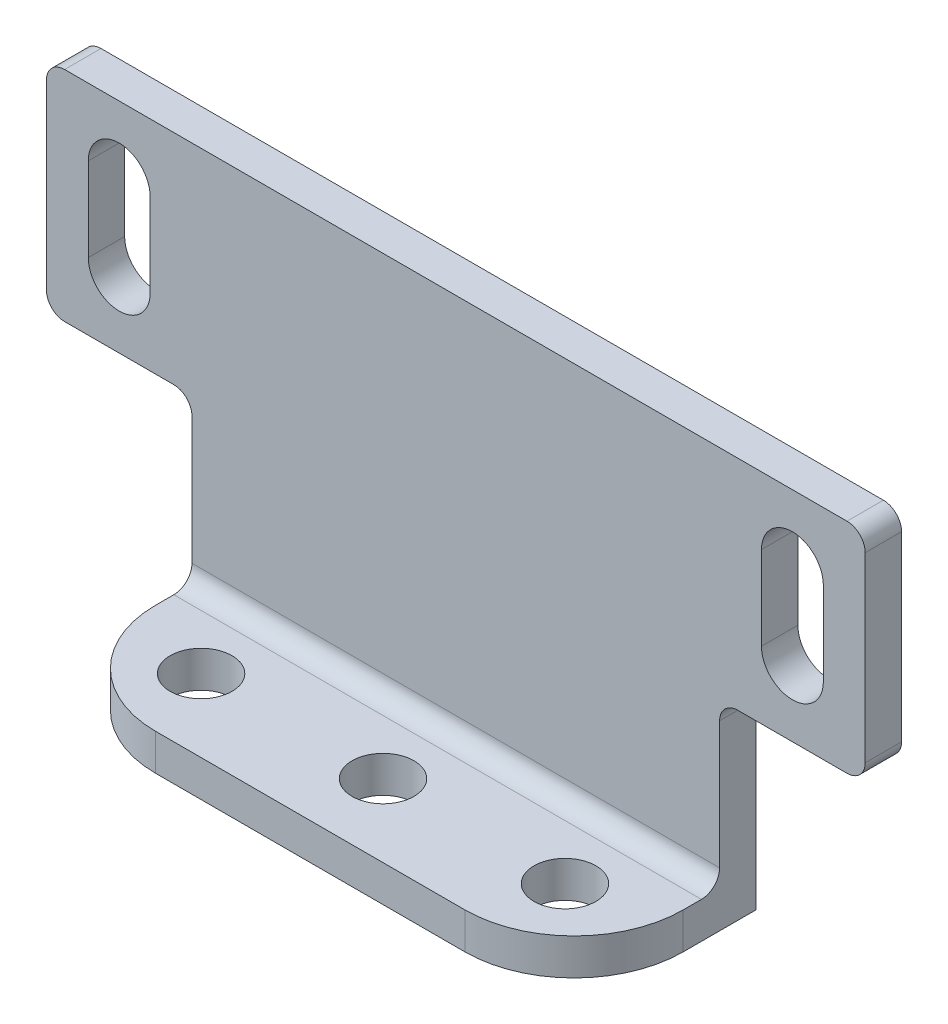
ISO-10303-21;
HEADER;
FILE_DESCRIPTION(('STEP AP214'),'2;1');
FILE_NAME('part.step','',(''),(''),'','','');
FILE_SCHEMA(('AUTOMOTIVE_DESIGN { 1 0 10303 214 1 1 1 1 }'));
ENDSEC;
DATA;
#1=APPLICATION_CONTEXT('core data for automotive mechanical design processes');
#2=APPLICATION_PROTOCOL_DEFINITION('international standard','automotive_design',2000,#1);
#3=PRODUCT_CONTEXT('',#1,'mechanical');
#4=PRODUCT('Part','Part','',(#3));
#5=PRODUCT_RELATED_PRODUCT_CATEGORY('part','',(#4));
#6=PRODUCT_DEFINITION_FORMATION('','',#4);
#7=PRODUCT_DEFINITION_CONTEXT('part definition',#1,'design');
#8=PRODUCT_DEFINITION('design','',#6,#7);
#9=PRODUCT_DEFINITION_SHAPE('','',#8);
#10=(LENGTH_UNIT() NAMED_UNIT(*) SI_UNIT(.MILLI.,.METRE.));
#11=(NAMED_UNIT(*) PLANE_ANGLE_UNIT() SI_UNIT($,.RADIAN.));
#12=(NAMED_UNIT(*) SI_UNIT($,.STERADIAN.) SOLID_ANGLE_UNIT());
#13=UNCERTAINTY_MEASURE_WITH_UNIT(LENGTH_MEASURE(1.E-05),#10,'distance_accuracy_value','');
#14=(GEOMETRIC_REPRESENTATION_CONTEXT(3) GLOBAL_UNCERTAINTY_ASSIGNED_CONTEXT((#13)) GLOBAL_UNIT_ASSIGNED_CONTEXT((#10,
#11,#12)) REPRESENTATION_CONTEXT('',''));
#15=CARTESIAN_POINT('',(0.,0.,0.));
#16=DIRECTION('',(0.,0.,1.));
#17=DIRECTION('',(1.,0.,0.));
#18=AXIS2_PLACEMENT_3D('',#15,#16,#17);
#19=CARTESIAN_POINT('',(22.5,5.,2.));
#20=DIRECTION('',(-1.,0.,0.));
#21=DIRECTION('',(0.,0.,1.));
#22=AXIS2_PLACEMENT_3D('',#19,#20,#21);
#23=PLANE('',#22);
#24=DIRECTION('',(0.,1.,0.));
#25=VECTOR('',#24,1.);
#26=CARTESIAN_POINT('',(22.5,5.,0.));
#27=LINE('',#26,#25);
#28=CARTESIAN_POINT('',(22.5,-6.,0.));
#29=VERTEX_POINT('',#28);
#30=CARTESIAN_POINT('',(22.5,4.,0.));
#31=VERTEX_POINT('',#30);
#32=EDGE_CURVE('E389',#29,#31,#27,.T.);
#33=ORIENTED_EDGE('',*,*,#32,.T.);
#34=DIRECTION('',(0.,0.,-1.));
#35=VECTOR('',#34,1.);
#36=CARTESIAN_POINT('',(22.5,4.,2.));
#37=LINE('',#36,#35);
#38=CARTESIAN_POINT('',(22.5,4.,2.));
#39=VERTEX_POINT('',#38);
#40=EDGE_CURVE('E467',#31,#39,#37,.F.);
#41=ORIENTED_EDGE('',*,*,#40,.T.);
#42=DIRECTION('',(0.,1.,0.));
#43=VECTOR('',#42,1.);
#44=CARTESIAN_POINT('',(22.5,5.,2.));
#45=LINE('',#44,#43);
#46=CARTESIAN_POINT('',(22.5,-6.,2.));
#47=VERTEX_POINT('',#46);
#48=EDGE_CURVE('E400',#47,#39,#45,.T.);
#49=ORIENTED_EDGE('',*,*,#48,.F.);
#50=DIRECTION('',(0.,0.,1.));
#51=VECTOR('',#50,1.);
#52=CARTESIAN_POINT('',(22.5,-6.,0.));
#53=LINE('',#52,#51);
#54=EDGE_CURVE('E465',#47,#29,#53,.F.);
#55=ORIENTED_EDGE('',*,*,#54,.T.);
#56=EDGE_LOOP('',(#33,#41,#49,#55));
#57=FACE_BOUND('',#56,.T.);
#58=ADVANCED_FACE('F183',(#57),#23,.F.);
#59=CARTESIAN_POINT('',(-22.5,-18.,2.));
#60=DIRECTION('',(0.,1.,0.));
#61=DIRECTION('',(0.,0.,1.));
#62=AXIS2_PLACEMENT_3D('',#59,#60,#61);
#63=PLANE('',#62);
#64=CARTESIAN_POINT('',(-10.,-18.,6.));
#65=DIRECTION('',(0.,1.,0.));
#66=DIRECTION('',(0.,0.,1.));
#67=AXIS2_PLACEMENT_3D('',#64,#65,#66);
#68=CIRCLE('',#67,1.7);
#69=CARTESIAN_POINT('',(-10.,-18.,7.7));
#70=VERTEX_POINT('',#69);
#71=EDGE_CURVE('E598',#70,#70,#68,.T.);
#72=ORIENTED_EDGE('',*,*,#71,.T.);
#73=EDGE_LOOP('',(#72));
#74=FACE_BOUND('',#73,.T.);
#75=CARTESIAN_POINT('',(0.,-18.,6.));
#76=DIRECTION('',(0.,1.,0.));
#77=DIRECTION('',(0.,0.,1.));
#78=AXIS2_PLACEMENT_3D('',#75,#76,#77);
#79=CIRCLE('',#78,1.7);
#80=CARTESIAN_POINT('',(0.,-18.,7.7));
#81=VERTEX_POINT('',#80);
#82=EDGE_CURVE('E592',#81,#81,#79,.T.);
#83=ORIENTED_EDGE('',*,*,#82,.T.);
#84=EDGE_LOOP('',(#83));
#85=FACE_BOUND('',#84,.T.);
#86=CARTESIAN_POINT('',(10.,-18.,6.));
#87=DIRECTION('',(0.,1.,0.));
#88=DIRECTION('',(0.,0.,1.));
#89=AXIS2_PLACEMENT_3D('',#86,#87,#88);
#90=CIRCLE('',#89,1.7);
#91=CARTESIAN_POINT('',(10.,-18.,7.7));
#92=VERTEX_POINT('',#91);
#93=EDGE_CURVE('E414',#92,#92,#90,.T.);
#94=ORIENTED_EDGE('',*,*,#93,.T.);
#95=EDGE_LOOP('',(#94));
#96=FACE_BOUND('',#95,.T.);
#97=DIRECTION('',(1.,0.,0.));
#98=VECTOR('',#97,1.);
#99=CARTESIAN_POINT('',(-22.5,-18.,0.));
#100=LINE('',#99,#98);
#101=CARTESIAN_POINT('',(-14.5,-18.,0.));
#102=VERTEX_POINT('',#101);
#103=CARTESIAN_POINT('',(14.5,-18.,0.));
#104=VERTEX_POINT('',#103);
#105=EDGE_CURVE('E365',#102,#104,#100,.T.);
#106=ORIENTED_EDGE('',*,*,#105,.T.);
#107=DIRECTION('',(0.,0.,-1.));
#108=VECTOR('',#107,1.);
#109=CARTESIAN_POINT('',(14.5,-18.,10.));
#110=LINE('',#109,#108);
#111=CARTESIAN_POINT('',(14.5,-18.,4.));
#112=VERTEX_POINT('',#111);
#113=EDGE_CURVE('E376',#112,#104,#110,.T.);
#114=ORIENTED_EDGE('',*,*,#113,.F.);
#115=CARTESIAN_POINT('',(8.50000000000001,-18.,4.));
#116=DIRECTION('',(0.,1.,0.));
#117=DIRECTION('',(0.,0.,1.));
#118=AXIS2_PLACEMENT_3D('',#115,#116,#117);
#119=CIRCLE('',#118,6.);
#120=CARTESIAN_POINT('',(8.5,-18.,10.));
#121=VERTEX_POINT('',#120);
#122=EDGE_CURVE('E429',#112,#121,#119,.F.);
#123=ORIENTED_EDGE('',*,*,#122,.T.);
#124=DIRECTION('',(1.,0.,0.));
#125=VECTOR('',#124,1.);
#126=CARTESIAN_POINT('',(-22.5,-18.,10.));
#127=LINE('',#126,#125);
#128=CARTESIAN_POINT('',(-8.49999999999999,-18.,10.));
#129=VERTEX_POINT('',#128);
#130=EDGE_CURVE('E396',#129,#121,#127,.T.);
#131=ORIENTED_EDGE('',*,*,#130,.F.);
#132=CARTESIAN_POINT('',(-8.49999999999999,-18.,4.));
#133=DIRECTION('',(0.,1.,0.));
#134=DIRECTION('',(0.,0.,1.));
#135=AXIS2_PLACEMENT_3D('',#132,#133,#134);
#136=CIRCLE('',#135,6.);
#137=CARTESIAN_POINT('',(-14.5,-18.,4.));
#138=VERTEX_POINT('',#137);
#139=EDGE_CURVE('E427',#129,#138,#136,.F.);
#140=ORIENTED_EDGE('',*,*,#139,.T.);
#141=DIRECTION('',(0.,0.,-1.));
#142=VECTOR('',#141,1.);
#143=CARTESIAN_POINT('',(-14.5,-18.,10.));
#144=LINE('',#143,#142);
#145=EDGE_CURVE('E388',#138,#102,#144,.T.);
#146=ORIENTED_EDGE('',*,*,#145,.T.);
#147=EDGE_LOOP('',(#106,#114,#123,#131,#140,#146));
#148=FACE_BOUND('',#147,.T.);
#149=ADVANCED_FACE('F386',(#74,#85,#96,#148),#63,.F.);
#150=CARTESIAN_POINT('',(0.,0.,2.));
#151=DIRECTION('',(0.,0.,1.));
#152=DIRECTION('',(1.,0.,0.));
#153=AXIS2_PLACEMENT_3D('',#150,#151,#152);
#154=PLANE('',#153);
#155=DIRECTION('',(0.,-1.,0.));
#156=VECTOR('',#155,1.);
#157=CARTESIAN_POINT('',(-20.2,0.,2.));
#158=LINE('',#157,#156);
#159=CARTESIAN_POINT('',(-20.2,1.29999999999999,2.));
#160=VERTEX_POINT('',#159);
#161=CARTESIAN_POINT('',(-20.2,-3.30000000000001,2.));
#162=VERTEX_POINT('',#161);
#163=EDGE_CURVE('E561',#160,#162,#158,.T.);
#164=ORIENTED_EDGE('',*,*,#163,.F.);
#165=CARTESIAN_POINT('',(-18.5,1.29999999999999,2.));
#166=DIRECTION('',(0.,0.,1.));
#167=DIRECTION('',(1.,0.,0.));
#168=AXIS2_PLACEMENT_3D('',#165,#166,#167);
#169=CIRCLE('',#168,1.69999999999999);
#170=CARTESIAN_POINT('',(-16.8,1.29999999999999,2.));
#171=VERTEX_POINT('',#170);
#172=EDGE_CURVE('E559',#171,#160,#169,.T.);
#173=ORIENTED_EDGE('',*,*,#172,.F.);
#174=DIRECTION('',(0.,-1.,0.));
#175=VECTOR('',#174,1.);
#176=CARTESIAN_POINT('',(-16.8,0.,2.));
#177=LINE('',#176,#175);
#178=CARTESIAN_POINT('',(-16.8,-3.30000000000001,2.));
#179=VERTEX_POINT('',#178);
#180=EDGE_CURVE('E563',#171,#179,#177,.T.);
#181=ORIENTED_EDGE('',*,*,#180,.T.);
#182=CARTESIAN_POINT('',(-18.5,-3.30000000000001,2.));
#183=DIRECTION('',(0.,0.,1.));
#184=DIRECTION('',(1.,0.,0.));
#185=AXIS2_PLACEMENT_3D('',#182,#183,#184);
#186=CIRCLE('',#185,1.69999999999999);
#187=EDGE_CURVE('E556',#162,#179,#186,.T.);
#188=ORIENTED_EDGE('',*,*,#187,.F.);
#189=EDGE_LOOP('',(#164,#173,#181,#188));
#190=FACE_BOUND('',#189,.T.);
#191=CARTESIAN_POINT('',(18.5,1.29999999999999,2.));
#192=DIRECTION('',(0.,0.,1.));
#193=DIRECTION('',(1.,0.,0.));
#194=AXIS2_PLACEMENT_3D('',#191,#192,#193);
#195=CIRCLE('',#194,1.69999999999999);
#196=CARTESIAN_POINT('',(20.2,1.29999999999999,2.));
#197=VERTEX_POINT('',#196);
#198=CARTESIAN_POINT('',(16.8,1.29999999999999,2.));
#199=VERTEX_POINT('',#198);
#200=EDGE_CURVE('E424',#197,#199,#195,.T.);
#201=ORIENTED_EDGE('',*,*,#200,.F.);
#202=DIRECTION('',(0.,-1.,0.));
#203=VECTOR('',#202,1.);
#204=CARTESIAN_POINT('',(20.2,0.,2.));
#205=LINE('',#204,#203);
#206=CARTESIAN_POINT('',(20.2,-3.30000000000001,2.));
#207=VERTEX_POINT('',#206);
#208=EDGE_CURVE('E408',#197,#207,#205,.T.);
#209=ORIENTED_EDGE('',*,*,#208,.T.);
#210=CARTESIAN_POINT('',(18.5,-3.30000000000001,2.));
#211=DIRECTION('',(0.,0.,1.));
#212=DIRECTION('',(1.,0.,0.));
#213=AXIS2_PLACEMENT_3D('',#210,#211,#212);
#214=CIRCLE('',#213,1.69999999999999);
#215=CARTESIAN_POINT('',(16.8,-3.30000000000001,2.));
#216=VERTEX_POINT('',#215);
#217=EDGE_CURVE('E421',#216,#207,#214,.T.);
#218=ORIENTED_EDGE('',*,*,#217,.F.);
#219=DIRECTION('',(0.,-1.,0.));
#220=VECTOR('',#219,1.);
#221=CARTESIAN_POINT('',(16.8,0.,2.));
#222=LINE('',#221,#220);
#223=EDGE_CURVE('E586',#199,#216,#222,.T.);
#224=ORIENTED_EDGE('',*,*,#223,.F.);
#225=EDGE_LOOP('',(#201,#209,#218,#224));
#226=FACE_BOUND('',#225,.T.);
#227=ORIENTED_EDGE('',*,*,#48,.T.);
#228=CARTESIAN_POINT('',(21.5,4.,2.));
#229=DIRECTION('',(0.,0.,1.));
#230=DIRECTION('',(1.,0.,0.));
#231=AXIS2_PLACEMENT_3D('',#228,#229,#230);
#232=CIRCLE('',#231,1.);
#233=CARTESIAN_POINT('',(21.5,5.,2.));
#234=VERTEX_POINT('',#233);
#235=EDGE_CURVE('E474',#39,#234,#232,.T.);
#236=ORIENTED_EDGE('',*,*,#235,.T.);
#237=DIRECTION('',(-1.,0.,0.));
#238=VECTOR('',#237,1.);
#239=CARTESIAN_POINT('',(-22.5,5.,2.));
#240=LINE('',#239,#238);
#241=CARTESIAN_POINT('',(-21.5,5.,2.));
#242=VERTEX_POINT('',#241);
#243=EDGE_CURVE('E403',#234,#242,#240,.T.);
#244=ORIENTED_EDGE('',*,*,#243,.T.);
#245=CARTESIAN_POINT('',(-21.5,4.,2.));
#246=DIRECTION('',(0.,0.,1.));
#247=DIRECTION('',(1.,0.,0.));
#248=AXIS2_PLACEMENT_3D('',#245,#246,#247);
#249=CIRCLE('',#248,1.);
#250=CARTESIAN_POINT('',(-22.5,4.,2.));
#251=VERTEX_POINT('',#250);
#252=EDGE_CURVE('E470',#242,#251,#249,.T.);
#253=ORIENTED_EDGE('',*,*,#252,.T.);
#254=DIRECTION('',(0.,-1.,0.));
#255=VECTOR('',#254,1.);
#256=CARTESIAN_POINT('',(-22.5,5.,2.));
#257=LINE('',#256,#255);
#258=CARTESIAN_POINT('',(-22.5,-6.,2.));
#259=VERTEX_POINT('',#258);
#260=EDGE_CURVE('E407',#251,#259,#257,.T.);
#261=ORIENTED_EDGE('',*,*,#260,.T.);
#262=CARTESIAN_POINT('',(-21.5,-6.,2.));
#263=DIRECTION('',(0.,0.,1.));
#264=DIRECTION('',(1.,0.,0.));
#265=AXIS2_PLACEMENT_3D('',#262,#263,#264);
#266=CIRCLE('',#265,1.);
#267=CARTESIAN_POINT('',(-21.5,-7.,2.));
#268=VERTEX_POINT('',#267);
#269=EDGE_CURVE('E203',#259,#268,#266,.T.);
#270=ORIENTED_EDGE('',*,*,#269,.T.);
#271=DIRECTION('',(-1.,0.,0.));
#272=VECTOR('',#271,1.);
#273=CARTESIAN_POINT('',(-22.5,-7.,2.));
#274=LINE('',#273,#272);
#275=CARTESIAN_POINT('',(-15.5,-7.,2.));
#276=VERTEX_POINT('',#275);
#277=EDGE_CURVE('E383',#276,#268,#274,.T.);
#278=ORIENTED_EDGE('',*,*,#277,.F.);
#279=CARTESIAN_POINT('',(-15.5,-8.,2.));
#280=DIRECTION('',(0.,0.,1.));
#281=DIRECTION('',(1.,0.,0.));
#282=AXIS2_PLACEMENT_3D('',#279,#280,#281);
#283=CIRCLE('',#282,1.);
#284=CARTESIAN_POINT('',(-14.5,-8.,2.));
#285=VERTEX_POINT('',#284);
#286=EDGE_CURVE('E191',#276,#285,#283,.F.);
#287=ORIENTED_EDGE('',*,*,#286,.T.);
#288=DIRECTION('',(0.,1.,0.));
#289=VECTOR('',#288,1.);
#290=CARTESIAN_POINT('',(-14.5,-18.,2.));
#291=LINE('',#290,#289);
#292=CARTESIAN_POINT('',(-14.5,-15.,2.));
#293=VERTEX_POINT('',#292);
#294=EDGE_CURVE('E520',#293,#285,#291,.T.);
#295=ORIENTED_EDGE('',*,*,#294,.F.);
#296=DIRECTION('',(1.,0.,0.));
#297=VECTOR('',#296,1.);
#298=CARTESIAN_POINT('',(0.,-15.,2.));
#299=LINE('',#298,#297);
#300=CARTESIAN_POINT('',(14.5,-15.,2.));
#301=VERTEX_POINT('',#300);
#302=EDGE_CURVE('E442',#293,#301,#299,.T.);
#303=ORIENTED_EDGE('',*,*,#302,.T.);
#304=DIRECTION('',(0.,1.,0.));
#305=VECTOR('',#304,1.);
#306=CARTESIAN_POINT('',(14.5,-18.,2.));
#307=LINE('',#306,#305);
#308=CARTESIAN_POINT('',(14.5,-8.,2.));
#309=VERTEX_POINT('',#308);
#310=EDGE_CURVE('E502',#301,#309,#307,.T.);
#311=ORIENTED_EDGE('',*,*,#310,.T.);
#312=CARTESIAN_POINT('',(15.5,-8.,2.));
#313=DIRECTION('',(0.,0.,1.));
#314=DIRECTION('',(1.,0.,0.));
#315=AXIS2_PLACEMENT_3D('',#312,#313,#314);
#316=CIRCLE('',#315,1.);
#317=CARTESIAN_POINT('',(15.5,-7.,2.));
#318=VERTEX_POINT('',#317);
#319=EDGE_CURVE('E496',#309,#318,#316,.F.);
#320=ORIENTED_EDGE('',*,*,#319,.T.);
#321=DIRECTION('',(1.,0.,0.));
#322=VECTOR('',#321,1.);
#323=CARTESIAN_POINT('',(22.5,-7.,2.));
#324=LINE('',#323,#322);
#325=CARTESIAN_POINT('',(21.5,-7.,2.));
#326=VERTEX_POINT('',#325);
#327=EDGE_CURVE('E372',#318,#326,#324,.T.);
#328=ORIENTED_EDGE('',*,*,#327,.T.);
#329=CARTESIAN_POINT('',(21.5,-6.,2.));
#330=DIRECTION('',(0.,0.,1.));
#331=DIRECTION('',(1.,0.,0.));
#332=AXIS2_PLACEMENT_3D('',#329,#330,#331);
#333=CIRCLE('',#332,1.);
#334=EDGE_CURVE('E472',#326,#47,#333,.T.);
#335=ORIENTED_EDGE('',*,*,#334,.T.);
#336=EDGE_LOOP('',(#227,#236,#244,#253,#261,#270,#278,#287,#295,#303,#311,#320,#328,#335));
#337=FACE_BOUND('',#336,.T.);
#338=ADVANCED_FACE('F501',(#190,#226,#337),#154,.T.);
#339=CARTESIAN_POINT('',(0.,0.,0.));
#340=DIRECTION('',(0.,0.,1.));
#341=DIRECTION('',(1.,0.,0.));
#342=AXIS2_PLACEMENT_3D('',#339,#340,#341);
#343=PLANE('',#342);
#344=CARTESIAN_POINT('',(18.5,-3.30000000000001,0.));
#345=DIRECTION('',(0.,0.,-1.));
#346=DIRECTION('',(-1.,0.,0.));
#347=AXIS2_PLACEMENT_3D('',#344,#345,#346);
#348=CIRCLE('',#347,1.69999999999999);
#349=CARTESIAN_POINT('',(20.2,-3.30000000000001,0.));
#350=VERTEX_POINT('',#349);
#351=CARTESIAN_POINT('',(16.8,-3.30000000000001,0.));
#352=VERTEX_POINT('',#351);
#353=EDGE_CURVE('E573',#350,#352,#348,.T.);
#354=ORIENTED_EDGE('',*,*,#353,.F.);
#355=DIRECTION('',(0.,1.,0.));
#356=VECTOR('',#355,1.);
#357=CARTESIAN_POINT('',(20.2,-3.30000000000001,0.));
#358=LINE('',#357,#356);
#359=CARTESIAN_POINT('',(20.2,1.29999999999999,0.));
#360=VERTEX_POINT('',#359);
#361=EDGE_CURVE('E568',#350,#360,#358,.T.);
#362=ORIENTED_EDGE('',*,*,#361,.T.);
#363=CARTESIAN_POINT('',(18.5,1.29999999999999,0.));
#364=DIRECTION('',(0.,0.,-1.));
#365=DIRECTION('',(-1.,0.,0.));
#366=AXIS2_PLACEMENT_3D('',#363,#364,#365);
#367=CIRCLE('',#366,1.69999999999999);
#368=CARTESIAN_POINT('',(16.8000000000001,1.29999999999999,0.));
#369=VERTEX_POINT('',#368);
#370=EDGE_CURVE('E581',#369,#360,#367,.T.);
#371=ORIENTED_EDGE('',*,*,#370,.F.);
#372=DIRECTION('',(0.,1.,0.));
#373=VECTOR('',#372,1.);
#374=CARTESIAN_POINT('',(16.8000000000001,-3.30000000000001,0.));
#375=LINE('',#374,#373);
#376=EDGE_CURVE('E566',#352,#369,#375,.T.);
#377=ORIENTED_EDGE('',*,*,#376,.F.);
#378=EDGE_LOOP('',(#354,#362,#371,#377));
#379=FACE_BOUND('',#378,.T.);
#380=CARTESIAN_POINT('',(-18.5,1.29999999999999,0.));
#381=DIRECTION('',(0.,0.,-1.));
#382=DIRECTION('',(-1.,0.,0.));
#383=AXIS2_PLACEMENT_3D('',#380,#381,#382);
#384=CIRCLE('',#383,1.69999999999999);
#385=CARTESIAN_POINT('',(-20.2,1.29999999999999,0.));
#386=VERTEX_POINT('',#385);
#387=CARTESIAN_POINT('',(-16.8,1.29999999999999,0.));
#388=VERTEX_POINT('',#387);
#389=EDGE_CURVE('E551',#386,#388,#384,.T.);
#390=ORIENTED_EDGE('',*,*,#389,.F.);
#391=DIRECTION('',(0.,1.,0.));
#392=VECTOR('',#391,1.);
#393=CARTESIAN_POINT('',(-20.2,-3.30000000000001,0.));
#394=LINE('',#393,#392);
#395=CARTESIAN_POINT('',(-20.2,-3.30000000000001,0.));
#396=VERTEX_POINT('',#395);
#397=EDGE_CURVE('E532',#396,#386,#394,.T.);
#398=ORIENTED_EDGE('',*,*,#397,.F.);
#399=CARTESIAN_POINT('',(-18.5,-3.30000000000001,0.));
#400=DIRECTION('',(0.,0.,-1.));
#401=DIRECTION('',(-1.,0.,0.));
#402=AXIS2_PLACEMENT_3D('',#399,#400,#401);
#403=CIRCLE('',#402,1.69999999999999);
#404=CARTESIAN_POINT('',(-16.8,-3.30000000000001,0.));
#405=VERTEX_POINT('',#404);
#406=EDGE_CURVE('E543',#405,#396,#403,.T.);
#407=ORIENTED_EDGE('',*,*,#406,.F.);
#408=DIRECTION('',(0.,1.,0.));
#409=VECTOR('',#408,1.);
#410=CARTESIAN_POINT('',(-16.8,-3.30000000000001,0.));
#411=LINE('',#410,#409);
#412=EDGE_CURVE('E538',#405,#388,#411,.T.);
#413=ORIENTED_EDGE('',*,*,#412,.T.);
#414=EDGE_LOOP('',(#390,#398,#407,#413));
#415=FACE_BOUND('',#414,.T.);
#416=DIRECTION('',(-1.,0.,0.));
#417=VECTOR('',#416,1.);
#418=CARTESIAN_POINT('',(-22.5,5.,0.));
#419=LINE('',#418,#417);
#420=CARTESIAN_POINT('',(21.5,5.,0.));
#421=VERTEX_POINT('',#420);
#422=CARTESIAN_POINT('',(-21.5,5.,0.));
#423=VERTEX_POINT('',#422);
#424=EDGE_CURVE('E393',#421,#423,#419,.T.);
#425=ORIENTED_EDGE('',*,*,#424,.F.);
#426=CARTESIAN_POINT('',(21.5,4.,0.));
#427=DIRECTION('',(0.,0.,1.));
#428=DIRECTION('',(1.,0.,0.));
#429=AXIS2_PLACEMENT_3D('',#426,#427,#428);
#430=CIRCLE('',#429,1.);
#431=EDGE_CURVE('E463',#421,#31,#430,.F.);
#432=ORIENTED_EDGE('',*,*,#431,.T.);
#433=ORIENTED_EDGE('',*,*,#32,.F.);
#434=CARTESIAN_POINT('',(21.5,-6.,0.));
#435=DIRECTION('',(0.,0.,1.));
#436=DIRECTION('',(1.,0.,0.));
#437=AXIS2_PLACEMENT_3D('',#434,#435,#436);
#438=CIRCLE('',#437,1.);
#439=CARTESIAN_POINT('',(21.5,-7.,0.));
#440=VERTEX_POINT('',#439);
#441=EDGE_CURVE('E461',#29,#440,#438,.F.);
#442=ORIENTED_EDGE('',*,*,#441,.T.);
#443=DIRECTION('',(-1.,0.,0.));
#444=VECTOR('',#443,1.);
#445=CARTESIAN_POINT('',(22.5,-7.,0.));
#446=LINE('',#445,#444);
#447=CARTESIAN_POINT('',(15.5,-7.,0.));
#448=VERTEX_POINT('',#447);
#449=EDGE_CURVE('E513',#440,#448,#446,.T.);
#450=ORIENTED_EDGE('',*,*,#449,.T.);
#451=CARTESIAN_POINT('',(15.5,-8.,0.));
#452=DIRECTION('',(0.,0.,1.));
#453=DIRECTION('',(1.,0.,0.));
#454=AXIS2_PLACEMENT_3D('',#451,#452,#453);
#455=CIRCLE('',#454,1.);
#456=CARTESIAN_POINT('',(14.5,-8.,0.));
#457=VERTEX_POINT('',#456);
#458=EDGE_CURVE('E368',#448,#457,#455,.T.);
#459=ORIENTED_EDGE('',*,*,#458,.T.);
#460=DIRECTION('',(0.,-1.,0.));
#461=VECTOR('',#460,1.);
#462=CARTESIAN_POINT('',(14.5,-18.,0.));
#463=LINE('',#462,#461);
#464=EDGE_CURVE('E359',#457,#104,#463,.T.);
#465=ORIENTED_EDGE('',*,*,#464,.T.);
#466=ORIENTED_EDGE('',*,*,#105,.F.);
#467=DIRECTION('',(0.,-1.,0.));
#468=VECTOR('',#467,1.);
#469=CARTESIAN_POINT('',(-14.5,-18.,0.));
#470=LINE('',#469,#468);
#471=CARTESIAN_POINT('',(-14.5,-8.,0.));
#472=VERTEX_POINT('',#471);
#473=EDGE_CURVE('E614',#472,#102,#470,.T.);
#474=ORIENTED_EDGE('',*,*,#473,.F.);
#475=CARTESIAN_POINT('',(-15.5,-8.,0.));
#476=DIRECTION('',(0.,0.,1.));
#477=DIRECTION('',(1.,0.,0.));
#478=AXIS2_PLACEMENT_3D('',#475,#476,#477);
#479=CIRCLE('',#478,1.);
#480=CARTESIAN_POINT('',(-15.5,-7.,0.));
#481=VERTEX_POINT('',#480);
#482=EDGE_CURVE('E13',#472,#481,#479,.T.);
#483=ORIENTED_EDGE('',*,*,#482,.T.);
#484=DIRECTION('',(1.,0.,0.));
#485=VECTOR('',#484,1.);
#486=CARTESIAN_POINT('',(-22.5,-7.,0.));
#487=LINE('',#486,#485);
#488=CARTESIAN_POINT('',(-21.5,-7.,0.));
#489=VERTEX_POINT('',#488);
#490=EDGE_CURVE('E523',#489,#481,#487,.T.);
#491=ORIENTED_EDGE('',*,*,#490,.F.);
#492=CARTESIAN_POINT('',(-21.5,-6.,0.));
#493=DIRECTION('',(0.,0.,1.));
#494=DIRECTION('',(1.,0.,0.));
#495=AXIS2_PLACEMENT_3D('',#492,#493,#494);
#496=CIRCLE('',#495,1.);
#497=CARTESIAN_POINT('',(-22.5,-6.,0.));
#498=VERTEX_POINT('',#497);
#499=EDGE_CURVE('E457',#489,#498,#496,.F.);
#500=ORIENTED_EDGE('',*,*,#499,.T.);
#501=DIRECTION('',(0.,-1.,0.));
#502=VECTOR('',#501,1.);
#503=CARTESIAN_POINT('',(-22.5,5.,0.));
#504=LINE('',#503,#502);
#505=CARTESIAN_POINT('',(-22.5,4.,0.));
#506=VERTEX_POINT('',#505);
#507=EDGE_CURVE('E404',#506,#498,#504,.T.);
#508=ORIENTED_EDGE('',*,*,#507,.F.);
#509=CARTESIAN_POINT('',(-21.5,4.,0.));
#510=DIRECTION('',(0.,0.,1.));
#511=DIRECTION('',(1.,0.,0.));
#512=AXIS2_PLACEMENT_3D('',#509,#510,#511);
#513=CIRCLE('',#512,1.);
#514=EDGE_CURVE('E459',#506,#423,#513,.F.);
#515=ORIENTED_EDGE('',*,*,#514,.T.);
#516=EDGE_LOOP('',(#425,#432,#433,#442,#450,#459,#465,#466,#474,#483,#491,#500,#508,#515));
#517=FACE_BOUND('',#516,.T.);
#518=ADVANCED_FACE('F362',(#379,#415,#517),#343,.F.);
#519=CARTESIAN_POINT('',(-22.5,-16.,10.));
#520=DIRECTION('',(0.,-1.,0.));
#521=DIRECTION('',(0.,0.,-1.));
#522=AXIS2_PLACEMENT_3D('',#519,#520,#521);
#523=PLANE('',#522);
#524=CARTESIAN_POINT('',(10.,-16.,6.));
#525=DIRECTION('',(0.,1.,0.));
#526=DIRECTION('',(0.,0.,1.));
#527=AXIS2_PLACEMENT_3D('',#524,#525,#526);
#528=CIRCLE('',#527,1.7);
#529=CARTESIAN_POINT('',(10.,-16.,7.7));
#530=VERTEX_POINT('',#529);
#531=EDGE_CURVE('E418',#530,#530,#528,.T.);
#532=ORIENTED_EDGE('',*,*,#531,.F.);
#533=EDGE_LOOP('',(#532));
#534=FACE_BOUND('',#533,.T.);
#535=CARTESIAN_POINT('',(0.,-16.,6.));
#536=DIRECTION('',(0.,1.,0.));
#537=DIRECTION('',(0.,0.,1.));
#538=AXIS2_PLACEMENT_3D('',#535,#536,#537);
#539=CIRCLE('',#538,1.7);
#540=CARTESIAN_POINT('',(0.,-16.,7.7));
#541=VERTEX_POINT('',#540);
#542=EDGE_CURVE('E417',#541,#541,#539,.T.);
#543=ORIENTED_EDGE('',*,*,#542,.F.);
#544=EDGE_LOOP('',(#543));
#545=FACE_BOUND('',#544,.T.);
#546=CARTESIAN_POINT('',(-10.,-16.,6.));
#547=DIRECTION('',(0.,1.,0.));
#548=DIRECTION('',(0.,0.,1.));
#549=AXIS2_PLACEMENT_3D('',#546,#547,#548);
#550=CIRCLE('',#549,1.7);
#551=CARTESIAN_POINT('',(-10.,-16.,7.7));
#552=VERTEX_POINT('',#551);
#553=EDGE_CURVE('E595',#552,#552,#550,.T.);
#554=ORIENTED_EDGE('',*,*,#553,.F.);
#555=EDGE_LOOP('',(#554));
#556=FACE_BOUND('',#555,.T.);
#557=DIRECTION('',(0.,0.,-1.));
#558=VECTOR('',#557,1.);
#559=CARTESIAN_POINT('',(14.5,-16.,10.));
#560=LINE('',#559,#558);
#561=CARTESIAN_POINT('',(14.5,-16.,4.));
#562=VERTEX_POINT('',#561);
#563=CARTESIAN_POINT('',(14.5,-16.,3.));
#564=VERTEX_POINT('',#563);
#565=EDGE_CURVE('E382',#562,#564,#560,.T.);
#566=ORIENTED_EDGE('',*,*,#565,.T.);
#567=DIRECTION('',(1.,0.,0.));
#568=VECTOR('',#567,1.);
#569=CARTESIAN_POINT('',(-22.5,-16.,3.));
#570=LINE('',#569,#568);
#571=CARTESIAN_POINT('',(-14.5,-16.,3.));
#572=VERTEX_POINT('',#571);
#573=EDGE_CURVE('E445',#564,#572,#570,.F.);
#574=ORIENTED_EDGE('',*,*,#573,.T.);
#575=DIRECTION('',(0.,0.,-1.));
#576=VECTOR('',#575,1.);
#577=CARTESIAN_POINT('',(-14.5,-16.,10.));
#578=LINE('',#577,#576);
#579=CARTESIAN_POINT('',(-14.5,-16.,4.));
#580=VERTEX_POINT('',#579);
#581=EDGE_CURVE('E528',#580,#572,#578,.T.);
#582=ORIENTED_EDGE('',*,*,#581,.F.);
#583=CARTESIAN_POINT('',(-8.49999999999999,-16.,4.));
#584=DIRECTION('',(0.,-1.,0.));
#585=DIRECTION('',(0.,0.,-1.));
#586=AXIS2_PLACEMENT_3D('',#583,#584,#585);
#587=CIRCLE('',#586,6.);
#588=CARTESIAN_POINT('',(-8.49999999999999,-16.,10.));
#589=VERTEX_POINT('',#588);
#590=EDGE_CURVE('E435',#580,#589,#587,.F.);
#591=ORIENTED_EDGE('',*,*,#590,.T.);
#592=DIRECTION('',(-1.,0.,0.));
#593=VECTOR('',#592,1.);
#594=CARTESIAN_POINT('',(-22.5,-16.,10.));
#595=LINE('',#594,#593);
#596=CARTESIAN_POINT('',(8.5,-16.,10.));
#597=VERTEX_POINT('',#596);
#598=EDGE_CURVE('E390',#597,#589,#595,.T.);
#599=ORIENTED_EDGE('',*,*,#598,.F.);
#600=CARTESIAN_POINT('',(8.50000000000001,-16.,4.));
#601=DIRECTION('',(0.,-1.,0.));
#602=DIRECTION('',(0.,0.,-1.));
#603=AXIS2_PLACEMENT_3D('',#600,#601,#602);
#604=CIRCLE('',#603,6.);
#605=EDGE_CURVE('E437',#597,#562,#604,.F.);
#606=ORIENTED_EDGE('',*,*,#605,.T.);
#607=EDGE_LOOP('',(#566,#574,#582,#591,#599,#606));
#608=FACE_BOUND('',#607,.T.);
#609=ADVANCED_FACE('F611',(#534,#545,#556,#608),#523,.F.);
#610=CARTESIAN_POINT('',(0.,0.,10.));
#611=DIRECTION('',(0.,0.,-1.));
#612=DIRECTION('',(-1.,0.,0.));
#613=AXIS2_PLACEMENT_3D('',#610,#611,#612);
#614=PLANE('',#613);
#615=ORIENTED_EDGE('',*,*,#130,.T.);
#616=DIRECTION('',(0.,-1.,0.));
#617=VECTOR('',#616,1.);
#618=CARTESIAN_POINT('',(8.50000000000001,-16.,10.));
#619=LINE('',#618,#617);
#620=EDGE_CURVE('E433',#121,#597,#619,.F.);
#621=ORIENTED_EDGE('',*,*,#620,.T.);
#622=ORIENTED_EDGE('',*,*,#598,.T.);
#623=DIRECTION('',(0.,1.,0.));
#624=VECTOR('',#623,1.);
#625=CARTESIAN_POINT('',(-8.49999999999999,-18.,10.));
#626=LINE('',#625,#624);
#627=EDGE_CURVE('E431',#589,#129,#626,.F.);
#628=ORIENTED_EDGE('',*,*,#627,.T.);
#629=EDGE_LOOP('',(#615,#621,#622,#628));
#630=FACE_BOUND('',#629,.T.);
#631=ADVANCED_FACE('F604',(#630),#614,.F.);
#632=CARTESIAN_POINT('',(-22.5,5.,2.));
#633=DIRECTION('',(0.,-1.,0.));
#634=DIRECTION('',(0.,0.,-1.));
#635=AXIS2_PLACEMENT_3D('',#632,#633,#634);
#636=PLANE('',#635);
#637=ORIENTED_EDGE('',*,*,#243,.F.);
#638=DIRECTION('',(0.,0.,-1.));
#639=VECTOR('',#638,1.);
#640=CARTESIAN_POINT('',(21.5,5.,2.));
#641=LINE('',#640,#639);
#642=EDGE_CURVE('E454',#234,#421,#641,.T.);
#643=ORIENTED_EDGE('',*,*,#642,.T.);
#644=ORIENTED_EDGE('',*,*,#424,.T.);
#645=DIRECTION('',(0.,0.,-1.));
#646=VECTOR('',#645,1.);
#647=CARTESIAN_POINT('',(-21.5,5.,2.));
#648=LINE('',#647,#646);
#649=EDGE_CURVE('E452',#423,#242,#648,.F.);
#650=ORIENTED_EDGE('',*,*,#649,.T.);
#651=EDGE_LOOP('',(#637,#643,#644,#650));
#652=FACE_BOUND('',#651,.T.);
#653=ADVANCED_FACE('F635',(#652),#636,.F.);
#654=CARTESIAN_POINT('',(-22.5,5.,2.));
#655=DIRECTION('',(1.,0.,0.));
#656=DIRECTION('',(0.,0.,-1.));
#657=AXIS2_PLACEMENT_3D('',#654,#655,#656);
#658=PLANE('',#657);
#659=ORIENTED_EDGE('',*,*,#260,.F.);
#660=DIRECTION('',(0.,0.,-1.));
#661=VECTOR('',#660,1.);
#662=CARTESIAN_POINT('',(-22.5,4.,2.));
#663=LINE('',#662,#661);
#664=EDGE_CURVE('E486',#251,#506,#663,.T.);
#665=ORIENTED_EDGE('',*,*,#664,.T.);
#666=ORIENTED_EDGE('',*,*,#507,.T.);
#667=DIRECTION('',(0.,0.,1.));
#668=VECTOR('',#667,1.);
#669=CARTESIAN_POINT('',(-22.5,-6.,2.));
#670=LINE('',#669,#668);
#671=EDGE_CURVE('E483',#498,#259,#670,.T.);
#672=ORIENTED_EDGE('',*,*,#671,.T.);
#673=EDGE_LOOP('',(#659,#665,#666,#672));
#674=FACE_BOUND('',#673,.T.);
#675=ADVANCED_FACE('F642',(#674),#658,.F.);
#676=CARTESIAN_POINT('',(-10.,-16.,6.));
#677=DIRECTION('',(0.,1.,0.));
#678=DIRECTION('',(0.,0.,1.));
#679=AXIS2_PLACEMENT_3D('',#676,#677,#678);
#680=CYLINDRICAL_SURFACE('',#679,1.7);
#681=ORIENTED_EDGE('',*,*,#553,.T.);
#682=EDGE_LOOP('',(#681));
#683=FACE_BOUND('',#682,.T.);
#684=ORIENTED_EDGE('',*,*,#71,.F.);
#685=EDGE_LOOP('',(#684));
#686=FACE_BOUND('',#685,.T.);
#687=ADVANCED_FACE('F783',(#683,#686),#680,.F.);
#688=CARTESIAN_POINT('',(0.,-16.,6.));
#689=DIRECTION('',(0.,1.,0.));
#690=DIRECTION('',(0.,0.,1.));
#691=AXIS2_PLACEMENT_3D('',#688,#689,#690);
#692=CYLINDRICAL_SURFACE('',#691,1.7);
#693=ORIENTED_EDGE('',*,*,#542,.T.);
#694=EDGE_LOOP('',(#693));
#695=FACE_BOUND('',#694,.T.);
#696=ORIENTED_EDGE('',*,*,#82,.F.);
#697=EDGE_LOOP('',(#696));
#698=FACE_BOUND('',#697,.T.);
#699=ADVANCED_FACE('F793',(#695,#698),#692,.F.);
#700=CARTESIAN_POINT('',(10.,-16.,6.));
#701=DIRECTION('',(0.,1.,0.));
#702=DIRECTION('',(0.,0.,1.));
#703=AXIS2_PLACEMENT_3D('',#700,#701,#702);
#704=CYLINDRICAL_SURFACE('',#703,1.7);
#705=ORIENTED_EDGE('',*,*,#531,.T.);
#706=EDGE_LOOP('',(#705));
#707=FACE_BOUND('',#706,.T.);
#708=ORIENTED_EDGE('',*,*,#93,.F.);
#709=EDGE_LOOP('',(#708));
#710=FACE_BOUND('',#709,.T.);
#711=ADVANCED_FACE('F800',(#707,#710),#704,.F.);
#712=CARTESIAN_POINT('',(18.5,1.29999999999999,0.));
#713=DIRECTION('',(0.,0.,-1.));
#714=DIRECTION('',(-1.,0.,0.));
#715=AXIS2_PLACEMENT_3D('',#712,#713,#714);
#716=CYLINDRICAL_SURFACE('',#715,1.69999999999999);
#717=ORIENTED_EDGE('',*,*,#200,.T.);
#718=DIRECTION('',(0.,0.,-1.));
#719=VECTOR('',#718,1.);
#720=CARTESIAN_POINT('',(16.8,1.29999999999999,0.));
#721=LINE('',#720,#719);
#722=EDGE_CURVE('E583',#369,#199,#721,.F.);
#723=ORIENTED_EDGE('',*,*,#722,.F.);
#724=ORIENTED_EDGE('',*,*,#370,.T.);
#725=DIRECTION('',(0.,0.,1.));
#726=VECTOR('',#725,1.);
#727=CARTESIAN_POINT('',(20.2,1.29999999999999,8.49999999999999));
#728=LINE('',#727,#726);
#729=EDGE_CURVE('E578',#360,#197,#728,.T.);
#730=ORIENTED_EDGE('',*,*,#729,.T.);
#731=EDGE_LOOP('',(#717,#723,#724,#730));
#732=FACE_BOUND('',#731,.T.);
#733=ADVANCED_FACE('F808',(#732),#716,.F.);
#734=CARTESIAN_POINT('',(18.5,-3.30000000000001,0.));
#735=DIRECTION('',(0.,0.,-1.));
#736=DIRECTION('',(-1.,0.,0.));
#737=AXIS2_PLACEMENT_3D('',#734,#735,#736);
#738=CYLINDRICAL_SURFACE('',#737,1.69999999999999);
#739=ORIENTED_EDGE('',*,*,#217,.T.);
#740=DIRECTION('',(0.,0.,1.));
#741=VECTOR('',#740,1.);
#742=CARTESIAN_POINT('',(20.2,-3.30000000000001,8.49999999999999));
#743=LINE('',#742,#741);
#744=EDGE_CURVE('E571',#350,#207,#743,.T.);
#745=ORIENTED_EDGE('',*,*,#744,.F.);
#746=ORIENTED_EDGE('',*,*,#353,.T.);
#747=DIRECTION('',(0.,0.,-1.));
#748=VECTOR('',#747,1.);
#749=CARTESIAN_POINT('',(16.8,-3.30000000000001,0.));
#750=LINE('',#749,#748);
#751=EDGE_CURVE('E575',#216,#352,#750,.T.);
#752=ORIENTED_EDGE('',*,*,#751,.F.);
#753=EDGE_LOOP('',(#739,#745,#746,#752));
#754=FACE_BOUND('',#753,.T.);
#755=ADVANCED_FACE('F816',(#754),#738,.F.);
#756=CARTESIAN_POINT('',(20.2,-3.30000000000001,8.49999999999999));
#757=DIRECTION('',(-1.,0.,0.));
#758=DIRECTION('',(0.,0.,1.));
#759=AXIS2_PLACEMENT_3D('',#756,#757,#758);
#760=PLANE('',#759);
#761=ORIENTED_EDGE('',*,*,#729,.F.);
#762=ORIENTED_EDGE('',*,*,#361,.F.);
#763=ORIENTED_EDGE('',*,*,#744,.T.);
#764=ORIENTED_EDGE('',*,*,#208,.F.);
#765=EDGE_LOOP('',(#761,#762,#763,#764));
#766=FACE_BOUND('',#765,.T.);
#767=ADVANCED_FACE('F824',(#766),#760,.T.);
#768=CARTESIAN_POINT('',(16.8,-3.30000000000001,0.));
#769=DIRECTION('',(-1.,0.,0.));
#770=DIRECTION('',(0.,0.,1.));
#771=AXIS2_PLACEMENT_3D('',#768,#769,#770);
#772=PLANE('',#771);
#773=ORIENTED_EDGE('',*,*,#223,.T.);
#774=ORIENTED_EDGE('',*,*,#751,.T.);
#775=ORIENTED_EDGE('',*,*,#376,.T.);
#776=ORIENTED_EDGE('',*,*,#722,.T.);
#777=EDGE_LOOP('',(#773,#774,#775,#776));
#778=FACE_BOUND('',#777,.T.);
#779=ADVANCED_FACE('F832',(#778),#772,.F.);
#780=CARTESIAN_POINT('',(-18.5,1.29999999999999,0.));
#781=DIRECTION('',(0.,0.,-1.));
#782=DIRECTION('',(-1.,0.,0.));
#783=AXIS2_PLACEMENT_3D('',#780,#781,#782);
#784=CYLINDRICAL_SURFACE('',#783,1.69999999999999);
#785=ORIENTED_EDGE('',*,*,#172,.T.);
#786=DIRECTION('',(0.,0.,-1.));
#787=VECTOR('',#786,1.);
#788=CARTESIAN_POINT('',(-20.2,1.29999999999999,0.));
#789=LINE('',#788,#787);
#790=EDGE_CURVE('E553',#386,#160,#789,.F.);
#791=ORIENTED_EDGE('',*,*,#790,.F.);
#792=ORIENTED_EDGE('',*,*,#389,.T.);
#793=DIRECTION('',(0.,0.,1.));
#794=VECTOR('',#793,1.);
#795=CARTESIAN_POINT('',(-16.8,1.29999999999999,8.49999999999999));
#796=LINE('',#795,#794);
#797=EDGE_CURVE('E548',#388,#171,#796,.T.);
#798=ORIENTED_EDGE('',*,*,#797,.T.);
#799=EDGE_LOOP('',(#785,#791,#792,#798));
#800=FACE_BOUND('',#799,.T.);
#801=ADVANCED_FACE('F840',(#800),#784,.F.);
#802=CARTESIAN_POINT('',(-18.5,-3.30000000000001,0.));
#803=DIRECTION('',(0.,0.,-1.));
#804=DIRECTION('',(-1.,0.,0.));
#805=AXIS2_PLACEMENT_3D('',#802,#803,#804);
#806=CYLINDRICAL_SURFACE('',#805,1.69999999999999);
#807=ORIENTED_EDGE('',*,*,#187,.T.);
#808=DIRECTION('',(0.,0.,1.));
#809=VECTOR('',#808,1.);
#810=CARTESIAN_POINT('',(-16.8,-3.30000000000001,8.49999999999999));
#811=LINE('',#810,#809);
#812=EDGE_CURVE('E541',#405,#179,#811,.T.);
#813=ORIENTED_EDGE('',*,*,#812,.F.);
#814=ORIENTED_EDGE('',*,*,#406,.T.);
#815=DIRECTION('',(0.,0.,-1.));
#816=VECTOR('',#815,1.);
#817=CARTESIAN_POINT('',(-20.2,-3.30000000000001,0.));
#818=LINE('',#817,#816);
#819=EDGE_CURVE('E546',#162,#396,#818,.T.);
#820=ORIENTED_EDGE('',*,*,#819,.F.);
#821=EDGE_LOOP('',(#807,#813,#814,#820));
#822=FACE_BOUND('',#821,.T.);
#823=ADVANCED_FACE('F848',(#822),#806,.F.);
#824=CARTESIAN_POINT('',(-16.8,-3.30000000000001,8.49999999999999));
#825=DIRECTION('',(-1.,0.,0.));
#826=DIRECTION('',(0.,0.,1.));
#827=AXIS2_PLACEMENT_3D('',#824,#825,#826);
#828=PLANE('',#827);
#829=ORIENTED_EDGE('',*,*,#797,.F.);
#830=ORIENTED_EDGE('',*,*,#412,.F.);
#831=ORIENTED_EDGE('',*,*,#812,.T.);
#832=ORIENTED_EDGE('',*,*,#180,.F.);
#833=EDGE_LOOP('',(#829,#830,#831,#832));
#834=FACE_BOUND('',#833,.T.);
#835=ADVANCED_FACE('F856',(#834),#828,.T.);
#836=CARTESIAN_POINT('',(-20.2,-3.30000000000001,0.));
#837=DIRECTION('',(-1.,0.,0.));
#838=DIRECTION('',(0.,0.,1.));
#839=AXIS2_PLACEMENT_3D('',#836,#837,#838);
#840=PLANE('',#839);
#841=ORIENTED_EDGE('',*,*,#163,.T.);
#842=ORIENTED_EDGE('',*,*,#819,.T.);
#843=ORIENTED_EDGE('',*,*,#397,.T.);
#844=ORIENTED_EDGE('',*,*,#790,.T.);
#845=EDGE_LOOP('',(#841,#842,#843,#844));
#846=FACE_BOUND('',#845,.T.);
#847=ADVANCED_FACE('F728',(#846),#840,.F.);
#848=CARTESIAN_POINT('',(14.5,-18.,10.));
#849=DIRECTION('',(1.,0.,0.));
#850=DIRECTION('',(0.,0.,-1.));
#851=AXIS2_PLACEMENT_3D('',#848,#849,#850);
#852=PLANE('',#851);
#853=ORIENTED_EDGE('',*,*,#464,.F.);
#854=DIRECTION('',(0.,0.,1.));
#855=VECTOR('',#854,1.);
#856=CARTESIAN_POINT('',(14.5,-8.,2.));
#857=LINE('',#856,#855);
#858=EDGE_CURVE('E481',#457,#309,#857,.T.);
#859=ORIENTED_EDGE('',*,*,#858,.T.);
#860=ORIENTED_EDGE('',*,*,#310,.F.);
#861=CARTESIAN_POINT('',(14.5,-15.,3.));
#862=DIRECTION('',(1.,0.,0.));
#863=DIRECTION('',(0.,0.,-1.));
#864=AXIS2_PLACEMENT_3D('',#861,#862,#863);
#865=CIRCLE('',#864,1.);
#866=EDGE_CURVE('E447',#301,#564,#865,.F.);
#867=ORIENTED_EDGE('',*,*,#866,.T.);
#868=ORIENTED_EDGE('',*,*,#565,.F.);
#869=DIRECTION('',(0.,-1.,0.));
#870=VECTOR('',#869,1.);
#871=CARTESIAN_POINT('',(14.5,-18.,4.));
#872=LINE('',#871,#870);
#873=EDGE_CURVE('E380',#562,#112,#872,.T.);
#874=ORIENTED_EDGE('',*,*,#873,.T.);
#875=ORIENTED_EDGE('',*,*,#113,.T.);
#876=EDGE_LOOP('',(#853,#859,#860,#867,#868,#874,#875));
#877=FACE_BOUND('',#876,.T.);
#878=ADVANCED_FACE('F377',(#877),#852,.T.);
#879=CARTESIAN_POINT('',(-14.5,-18.,10.));
#880=DIRECTION('',(-1.,0.,0.));
#881=DIRECTION('',(0.,0.,1.));
#882=AXIS2_PLACEMENT_3D('',#879,#880,#881);
#883=PLANE('',#882);
#884=ORIENTED_EDGE('',*,*,#294,.T.);
#885=DIRECTION('',(0.,0.,1.));
#886=VECTOR('',#885,1.);
#887=CARTESIAN_POINT('',(-14.5,-8.,10.));
#888=LINE('',#887,#886);
#889=EDGE_CURVE('E494',#285,#472,#888,.F.);
#890=ORIENTED_EDGE('',*,*,#889,.T.);
#891=ORIENTED_EDGE('',*,*,#473,.T.);
#892=ORIENTED_EDGE('',*,*,#145,.F.);
#893=DIRECTION('',(0.,1.,0.));
#894=VECTOR('',#893,1.);
#895=CARTESIAN_POINT('',(-14.5,-16.,4.));
#896=LINE('',#895,#894);
#897=EDGE_CURVE('E439',#138,#580,#896,.T.);
#898=ORIENTED_EDGE('',*,*,#897,.T.);
#899=ORIENTED_EDGE('',*,*,#581,.T.);
#900=CARTESIAN_POINT('',(-14.5,-15.,3.));
#901=DIRECTION('',(-1.,0.,0.));
#902=DIRECTION('',(0.,0.,1.));
#903=AXIS2_PLACEMENT_3D('',#900,#901,#902);
#904=CIRCLE('',#903,1.);
#905=EDGE_CURVE('E449',#572,#293,#904,.F.);
#906=ORIENTED_EDGE('',*,*,#905,.T.);
#907=EDGE_LOOP('',(#884,#890,#891,#892,#898,#899,#906));
#908=FACE_BOUND('',#907,.T.);
#909=ADVANCED_FACE('F526',(#908),#883,.T.);
#910=CARTESIAN_POINT('',(8.50000000000001,-18.,4.));
#911=DIRECTION('',(0.,1.,0.));
#912=DIRECTION('',(0.,0.,1.));
#913=AXIS2_PLACEMENT_3D('',#910,#911,#912);
#914=CYLINDRICAL_SURFACE('',#913,6.);
#915=ORIENTED_EDGE('',*,*,#605,.F.);
#916=ORIENTED_EDGE('',*,*,#620,.F.);
#917=ORIENTED_EDGE('',*,*,#122,.F.);
#918=ORIENTED_EDGE('',*,*,#873,.F.);
#919=EDGE_LOOP('',(#915,#916,#917,#918));
#920=FACE_BOUND('',#919,.T.);
#921=ADVANCED_FACE('F610',(#920),#914,.T.);
#922=CARTESIAN_POINT('',(-8.49999999999999,-18.,4.));
#923=DIRECTION('',(0.,-1.,0.));
#924=DIRECTION('',(0.,0.,-1.));
#925=AXIS2_PLACEMENT_3D('',#922,#923,#924);
#926=CYLINDRICAL_SURFACE('',#925,6.);
#927=ORIENTED_EDGE('',*,*,#139,.F.);
#928=ORIENTED_EDGE('',*,*,#627,.F.);
#929=ORIENTED_EDGE('',*,*,#590,.F.);
#930=ORIENTED_EDGE('',*,*,#897,.F.);
#931=EDGE_LOOP('',(#927,#928,#929,#930));
#932=FACE_BOUND('',#931,.T.);
#933=ADVANCED_FACE('F613',(#932),#926,.T.);
#934=CARTESIAN_POINT('',(0.,-15.,3.));
#935=DIRECTION('',(1.,0.,0.));
#936=DIRECTION('',(0.,0.,-1.));
#937=AXIS2_PLACEMENT_3D('',#934,#935,#936);
#938=CYLINDRICAL_SURFACE('',#937,1.);
#939=ORIENTED_EDGE('',*,*,#905,.F.);
#940=ORIENTED_EDGE('',*,*,#573,.F.);
#941=ORIENTED_EDGE('',*,*,#866,.F.);
#942=ORIENTED_EDGE('',*,*,#302,.F.);
#943=EDGE_LOOP('',(#939,#940,#941,#942));
#944=FACE_BOUND('',#943,.T.);
#945=ADVANCED_FACE('F519',(#944),#938,.F.);
#946=CARTESIAN_POINT('',(-22.5,-7.,-0.00100000000000143));
#947=DIRECTION('',(0.,1.,0.));
#948=DIRECTION('',(0.,0.,1.));
#949=AXIS2_PLACEMENT_3D('',#946,#947,#948);
#950=PLANE('',#949);
#951=ORIENTED_EDGE('',*,*,#277,.T.);
#952=DIRECTION('',(0.,0.,1.));
#953=VECTOR('',#952,1.);
#954=CARTESIAN_POINT('',(-21.5,-7.,-0.00100000000000143));
#955=LINE('',#954,#953);
#956=EDGE_CURVE('E492',#268,#489,#955,.F.);
#957=ORIENTED_EDGE('',*,*,#956,.T.);
#958=ORIENTED_EDGE('',*,*,#490,.T.);
#959=DIRECTION('',(0.,0.,1.));
#960=VECTOR('',#959,1.);
#961=CARTESIAN_POINT('',(-15.5,-7.,-0.00100000000000143));
#962=LINE('',#961,#960);
#963=EDGE_CURVE('E489',#481,#276,#962,.T.);
#964=ORIENTED_EDGE('',*,*,#963,.T.);
#965=EDGE_LOOP('',(#951,#957,#958,#964));
#966=FACE_BOUND('',#965,.T.);
#967=ADVANCED_FACE('F651',(#966),#950,.F.);
#968=CARTESIAN_POINT('',(22.5,-7.,-0.00100000000000143));
#969=DIRECTION('',(0.,-1.,0.));
#970=DIRECTION('',(0.,0.,-1.));
#971=AXIS2_PLACEMENT_3D('',#968,#969,#970);
#972=PLANE('',#971);
#973=ORIENTED_EDGE('',*,*,#449,.F.);
#974=DIRECTION('',(0.,0.,1.));
#975=VECTOR('',#974,1.);
#976=CARTESIAN_POINT('',(21.5,-7.,2.));
#977=LINE('',#976,#975);
#978=EDGE_CURVE('E478',#440,#326,#977,.T.);
#979=ORIENTED_EDGE('',*,*,#978,.T.);
#980=ORIENTED_EDGE('',*,*,#327,.F.);
#981=DIRECTION('',(0.,0.,1.));
#982=VECTOR('',#981,1.);
#983=CARTESIAN_POINT('',(15.5,-7.,0.));
#984=LINE('',#983,#982);
#985=EDGE_CURVE('E476',#318,#448,#984,.F.);
#986=ORIENTED_EDGE('',*,*,#985,.T.);
#987=EDGE_LOOP('',(#973,#979,#980,#986));
#988=FACE_BOUND('',#987,.T.);
#989=ADVANCED_FACE('F507',(#988),#972,.T.);
#990=CARTESIAN_POINT('',(21.5,4.,2.));
#991=DIRECTION('',(0.,0.,-1.));
#992=DIRECTION('',(-1.,0.,0.));
#993=AXIS2_PLACEMENT_3D('',#990,#991,#992);
#994=CYLINDRICAL_SURFACE('',#993,1.);
#995=ORIENTED_EDGE('',*,*,#235,.F.);
#996=ORIENTED_EDGE('',*,*,#40,.F.);
#997=ORIENTED_EDGE('',*,*,#431,.F.);
#998=ORIENTED_EDGE('',*,*,#642,.F.);
#999=EDGE_LOOP('',(#995,#996,#997,#998));
#1000=FACE_BOUND('',#999,.T.);
#1001=ADVANCED_FACE('F630',(#1000),#994,.T.);
#1002=CARTESIAN_POINT('',(21.5,-6.,-0.00100000000000143));
#1003=DIRECTION('',(0.,0.,-1.));
#1004=DIRECTION('',(-1.,0.,0.));
#1005=AXIS2_PLACEMENT_3D('',#1002,#1003,#1004);
#1006=CYLINDRICAL_SURFACE('',#1005,1.);
#1007=ORIENTED_EDGE('',*,*,#441,.F.);
#1008=ORIENTED_EDGE('',*,*,#54,.F.);
#1009=ORIENTED_EDGE('',*,*,#334,.F.);
#1010=ORIENTED_EDGE('',*,*,#978,.F.);
#1011=EDGE_LOOP('',(#1007,#1008,#1009,#1010));
#1012=FACE_BOUND('',#1011,.T.);
#1013=ADVANCED_FACE('F623',(#1012),#1006,.T.);
#1014=CARTESIAN_POINT('',(15.5,-8.,10.));
#1015=DIRECTION('',(0.,0.,-1.));
#1016=DIRECTION('',(-1.,0.,0.));
#1017=AXIS2_PLACEMENT_3D('',#1014,#1015,#1016);
#1018=CYLINDRICAL_SURFACE('',#1017,1.);
#1019=ORIENTED_EDGE('',*,*,#458,.F.);
#1020=ORIENTED_EDGE('',*,*,#985,.F.);
#1021=ORIENTED_EDGE('',*,*,#319,.F.);
#1022=ORIENTED_EDGE('',*,*,#858,.F.);
#1023=EDGE_LOOP('',(#1019,#1020,#1021,#1022));
#1024=FACE_BOUND('',#1023,.T.);
#1025=ADVANCED_FACE('F510',(#1024),#1018,.F.);
#1026=CARTESIAN_POINT('',(-21.5,4.,2.));
#1027=DIRECTION('',(0.,0.,-1.));
#1028=DIRECTION('',(-1.,0.,0.));
#1029=AXIS2_PLACEMENT_3D('',#1026,#1027,#1028);
#1030=CYLINDRICAL_SURFACE('',#1029,1.);
#1031=ORIENTED_EDGE('',*,*,#252,.F.);
#1032=ORIENTED_EDGE('',*,*,#649,.F.);
#1033=ORIENTED_EDGE('',*,*,#514,.F.);
#1034=ORIENTED_EDGE('',*,*,#664,.F.);
#1035=EDGE_LOOP('',(#1031,#1032,#1033,#1034));
#1036=FACE_BOUND('',#1035,.T.);
#1037=ADVANCED_FACE('F638',(#1036),#1030,.T.);
#1038=CARTESIAN_POINT('',(-21.5,-6.,2.));
#1039=DIRECTION('',(0.,0.,1.));
#1040=DIRECTION('',(1.,0.,0.));
#1041=AXIS2_PLACEMENT_3D('',#1038,#1039,#1040);
#1042=CYLINDRICAL_SURFACE('',#1041,1.);
#1043=ORIENTED_EDGE('',*,*,#499,.F.);
#1044=ORIENTED_EDGE('',*,*,#956,.F.);
#1045=ORIENTED_EDGE('',*,*,#269,.F.);
#1046=ORIENTED_EDGE('',*,*,#671,.F.);
#1047=EDGE_LOOP('',(#1043,#1044,#1045,#1046));
#1048=FACE_BOUND('',#1047,.T.);
#1049=ADVANCED_FACE('F647',(#1048),#1042,.T.);
#1050=CARTESIAN_POINT('',(-15.5,-8.,-0.00100000000000143));
#1051=DIRECTION('',(0.,0.,1.));
#1052=DIRECTION('',(1.,0.,0.));
#1053=AXIS2_PLACEMENT_3D('',#1050,#1051,#1052);
#1054=CYLINDRICAL_SURFACE('',#1053,1.);
#1055=ORIENTED_EDGE('',*,*,#482,.F.);
#1056=ORIENTED_EDGE('',*,*,#889,.F.);
#1057=ORIENTED_EDGE('',*,*,#286,.F.);
#1058=ORIENTED_EDGE('',*,*,#963,.F.);
#1059=EDGE_LOOP('',(#1055,#1056,#1057,#1058));
#1060=FACE_BOUND('',#1059,.T.);
#1061=ADVANCED_FACE('F185',(#1060),#1054,.F.);
#1062=CLOSED_SHELL('',(#58,#149,#338,#518,#609,#631,#653,#675,#687,#699,#711,#733,#755,#767,
#779,#801,#823,#835,#847,#878,#909,#921,#933,#945,#967,#989,#1001,#1013,#1025,#1037,#1049,#1061));
#1063=MANIFOLD_SOLID_BREP('B2',#1062);
#1064=ADVANCED_BREP_SHAPE_REPRESENTATION('',(#18,#1063),#14);
#1065=SHAPE_DEFINITION_REPRESENTATION(#9,#1064);
ENDSEC;
END-ISO-10303-21;
